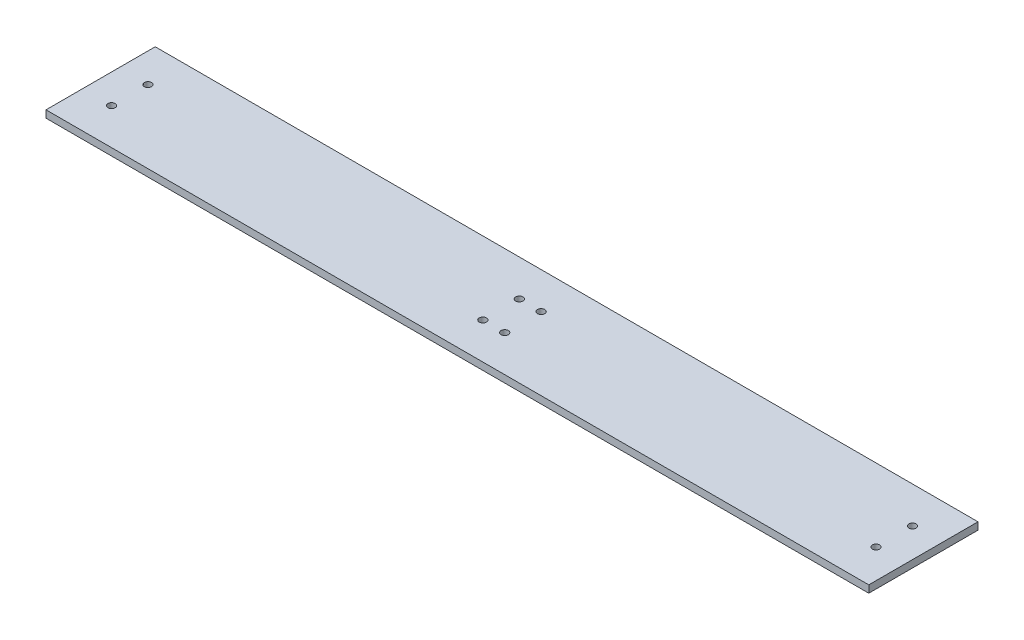
ISO-10303-21;
HEADER;
FILE_DESCRIPTION(('STEP AP214'),'2;1');
FILE_NAME('part.step','',(''),(''),'','','');
FILE_SCHEMA(('AUTOMOTIVE_DESIGN { 1 0 10303 214 1 1 1 1 }'));
ENDSEC;
DATA;
#1=APPLICATION_CONTEXT('core data for automotive mechanical design processes');
#2=APPLICATION_PROTOCOL_DEFINITION('international standard','automotive_design',2000,#1);
#3=PRODUCT_CONTEXT('',#1,'mechanical');
#4=PRODUCT('Part','Part','',(#3));
#5=PRODUCT_RELATED_PRODUCT_CATEGORY('part','',(#4));
#6=PRODUCT_DEFINITION_FORMATION('','',#4);
#7=PRODUCT_DEFINITION_CONTEXT('part definition',#1,'design');
#8=PRODUCT_DEFINITION('design','',#6,#7);
#9=PRODUCT_DEFINITION_SHAPE('','',#8);
#10=(LENGTH_UNIT() NAMED_UNIT(*) SI_UNIT(.MILLI.,.METRE.));
#11=(NAMED_UNIT(*) PLANE_ANGLE_UNIT() SI_UNIT($,.RADIAN.));
#12=(NAMED_UNIT(*) SI_UNIT($,.STERADIAN.) SOLID_ANGLE_UNIT());
#13=UNCERTAINTY_MEASURE_WITH_UNIT(LENGTH_MEASURE(1.E-05),#10,'distance_accuracy_value','');
#14=(GEOMETRIC_REPRESENTATION_CONTEXT(3) GLOBAL_UNCERTAINTY_ASSIGNED_CONTEXT((#13)) GLOBAL_UNIT_ASSIGNED_CONTEXT((#10,
#11,#12)) REPRESENTATION_CONTEXT('',''));
#15=CARTESIAN_POINT('',(0.,0.,0.));
#16=DIRECTION('',(0.,0.,1.));
#17=DIRECTION('',(1.,0.,0.));
#18=AXIS2_PLACEMENT_3D('',#15,#16,#17);
#19=CARTESIAN_POINT('',(1130.,0.,0.));
#20=DIRECTION('',(0.,0.,-1.));
#21=DIRECTION('',(-1.,0.,0.));
#22=AXIS2_PLACEMENT_3D('',#19,#20,#21);
#23=PLANE('',#22);
#24=DIRECTION('',(0.,-1.,0.));
#25=VECTOR('',#24,1.);
#26=CARTESIAN_POINT('',(0.,0.,0.));
#27=LINE('',#26,#25);
#28=CARTESIAN_POINT('',(0.,10.,0.));
#29=VERTEX_POINT('',#28);
#30=CARTESIAN_POINT('',(0.,0.,0.));
#31=VERTEX_POINT('',#30);
#32=EDGE_CURVE('E97',#29,#31,#27,.T.);
#33=ORIENTED_EDGE('',*,*,#32,.T.);
#34=DIRECTION('',(-1.,0.,0.));
#35=VECTOR('',#34,1.);
#36=CARTESIAN_POINT('',(1130.,0.,0.));
#37=LINE('',#36,#35);
#38=CARTESIAN_POINT('',(1130.,0.,0.));
#39=VERTEX_POINT('',#38);
#40=EDGE_CURVE('E11',#39,#31,#37,.T.);
#41=ORIENTED_EDGE('',*,*,#40,.F.);
#42=DIRECTION('',(0.,-1.,0.));
#43=VECTOR('',#42,1.);
#44=CARTESIAN_POINT('',(1130.,0.,0.));
#45=LINE('',#44,#43);
#46=CARTESIAN_POINT('',(1130.,10.,0.));
#47=VERTEX_POINT('',#46);
#48=EDGE_CURVE('E85',#47,#39,#45,.T.);
#49=ORIENTED_EDGE('',*,*,#48,.F.);
#50=DIRECTION('',(-1.,0.,0.));
#51=VECTOR('',#50,1.);
#52=CARTESIAN_POINT('',(1130.,10.,0.));
#53=LINE('',#52,#51);
#54=EDGE_CURVE('E93',#47,#29,#53,.T.);
#55=ORIENTED_EDGE('',*,*,#54,.T.);
#56=EDGE_LOOP('',(#33,#41,#49,#55));
#57=FACE_BOUND('',#56,.T.);
#58=ADVANCED_FACE('F34',(#57),#23,.F.);
#59=CARTESIAN_POINT('',(1130.,0.,0.));
#60=DIRECTION('',(0.,1.,0.));
#61=DIRECTION('',(0.,0.,1.));
#62=AXIS2_PLACEMENT_3D('',#59,#60,#61);
#63=PLANE('',#62);
#64=CARTESIAN_POINT('',(1090.,0.,-50.0000000000001));
#65=DIRECTION('',(0.,1.,0.));
#66=DIRECTION('',(0.,0.,-1.));
#67=AXIS2_PLACEMENT_3D('',#64,#65,#66);
#68=CIRCLE('',#67,4.99999999999982);
#69=CARTESIAN_POINT('',(1090.,0.,-55.));
#70=VERTEX_POINT('',#69);
#71=EDGE_CURVE('E150',#70,#70,#68,.T.);
#72=ORIENTED_EDGE('',*,*,#71,.T.);
#73=EDGE_LOOP('',(#72));
#74=FACE_BOUND('',#73,.T.);
#75=CARTESIAN_POINT('',(580.,0.,-50.));
#76=DIRECTION('',(0.,1.,0.));
#77=DIRECTION('',(0.,0.,-1.));
#78=AXIS2_PLACEMENT_3D('',#75,#76,#77);
#79=CIRCLE('',#78,5.00000000000005);
#80=CARTESIAN_POINT('',(580.,0.,-55.0000000000001));
#81=VERTEX_POINT('',#80);
#82=EDGE_CURVE('E144',#81,#81,#79,.T.);
#83=ORIENTED_EDGE('',*,*,#82,.T.);
#84=EDGE_LOOP('',(#83));
#85=FACE_BOUND('',#84,.T.);
#86=CARTESIAN_POINT('',(580.,0.,-100.));
#87=DIRECTION('',(0.,1.,0.));
#88=DIRECTION('',(0.,0.,-1.));
#89=AXIS2_PLACEMENT_3D('',#86,#87,#88);
#90=CIRCLE('',#89,5.00000000000005);
#91=CARTESIAN_POINT('',(580.,0.,-105.));
#92=VERTEX_POINT('',#91);
#93=EDGE_CURVE('E138',#92,#92,#90,.T.);
#94=ORIENTED_EDGE('',*,*,#93,.T.);
#95=EDGE_LOOP('',(#94));
#96=FACE_BOUND('',#95,.T.);
#97=CARTESIAN_POINT('',(1090.,0.,-100.));
#98=DIRECTION('',(0.,1.,0.));
#99=DIRECTION('',(0.,0.,-1.));
#100=AXIS2_PLACEMENT_3D('',#97,#98,#99);
#101=CIRCLE('',#100,5.00000000000005);
#102=CARTESIAN_POINT('',(1090.,0.,-105.));
#103=VERTEX_POINT('',#102);
#104=EDGE_CURVE('E132',#103,#103,#101,.T.);
#105=ORIENTED_EDGE('',*,*,#104,.T.);
#106=EDGE_LOOP('',(#105));
#107=FACE_BOUND('',#106,.T.);
#108=CARTESIAN_POINT('',(39.9999999999998,0.,-100.));
#109=DIRECTION('',(0.,1.,0.));
#110=DIRECTION('',(0.,0.,1.));
#111=AXIS2_PLACEMENT_3D('',#108,#109,#110);
#112=CIRCLE('',#111,5.);
#113=CARTESIAN_POINT('',(39.9999999999998,0.,-95.));
#114=VERTEX_POINT('',#113);
#115=EDGE_CURVE('E126',#114,#114,#112,.T.);
#116=ORIENTED_EDGE('',*,*,#115,.T.);
#117=EDGE_LOOP('',(#116));
#118=FACE_BOUND('',#117,.T.);
#119=CARTESIAN_POINT('',(550.,0.,-100.));
#120=DIRECTION('',(0.,1.,0.));
#121=DIRECTION('',(0.,0.,1.));
#122=AXIS2_PLACEMENT_3D('',#119,#120,#121);
#123=CIRCLE('',#122,5.00000000000005);
#124=CARTESIAN_POINT('',(550.,0.,-95.));
#125=VERTEX_POINT('',#124);
#126=EDGE_CURVE('E120',#125,#125,#123,.T.);
#127=ORIENTED_EDGE('',*,*,#126,.T.);
#128=EDGE_LOOP('',(#127));
#129=FACE_BOUND('',#128,.T.);
#130=CARTESIAN_POINT('',(550.,0.,-50.));
#131=DIRECTION('',(0.,1.,0.));
#132=DIRECTION('',(0.,0.,1.));
#133=AXIS2_PLACEMENT_3D('',#130,#131,#132);
#134=CIRCLE('',#133,5.00000000000004);
#135=CARTESIAN_POINT('',(550.,0.,-45.));
#136=VERTEX_POINT('',#135);
#137=EDGE_CURVE('E114',#136,#136,#134,.T.);
#138=ORIENTED_EDGE('',*,*,#137,.T.);
#139=EDGE_LOOP('',(#138));
#140=FACE_BOUND('',#139,.T.);
#141=CARTESIAN_POINT('',(40.,0.,-50.));
#142=DIRECTION('',(0.,1.,0.));
#143=DIRECTION('',(0.,0.,1.));
#144=AXIS2_PLACEMENT_3D('',#141,#142,#143);
#145=CIRCLE('',#144,5.);
#146=CARTESIAN_POINT('',(40.,0.,-45.));
#147=VERTEX_POINT('',#146);
#148=EDGE_CURVE('E100',#147,#147,#145,.T.);
#149=ORIENTED_EDGE('',*,*,#148,.T.);
#150=EDGE_LOOP('',(#149));
#151=FACE_BOUND('',#150,.T.);
#152=DIRECTION('',(0.,0.,-1.));
#153=VECTOR('',#152,1.);
#154=CARTESIAN_POINT('',(0.,0.,0.));
#155=LINE('',#154,#153);
#156=CARTESIAN_POINT('',(0.,0.,-150.));
#157=VERTEX_POINT('',#156);
#158=EDGE_CURVE('E89',#31,#157,#155,.T.);
#159=ORIENTED_EDGE('',*,*,#158,.T.);
#160=DIRECTION('',(-1.,0.,0.));
#161=VECTOR('',#160,1.);
#162=CARTESIAN_POINT('',(1130.,0.,-150.));
#163=LINE('',#162,#161);
#164=CARTESIAN_POINT('',(1130.,0.,-150.));
#165=VERTEX_POINT('',#164);
#166=EDGE_CURVE('E42',#165,#157,#163,.T.);
#167=ORIENTED_EDGE('',*,*,#166,.F.);
#168=DIRECTION('',(0.,0.,-1.));
#169=VECTOR('',#168,1.);
#170=CARTESIAN_POINT('',(1130.,0.,0.));
#171=LINE('',#170,#169);
#172=EDGE_CURVE('E80',#39,#165,#171,.T.);
#173=ORIENTED_EDGE('',*,*,#172,.F.);
#174=ORIENTED_EDGE('',*,*,#40,.T.);
#175=EDGE_LOOP('',(#159,#167,#173,#174));
#176=FACE_BOUND('',#175,.T.);
#177=ADVANCED_FACE('F88',(#74,#85,#96,#107,#118,#129,#140,#151,#176),#63,.F.);
#178=CARTESIAN_POINT('',(1130.,0.,-150.));
#179=DIRECTION('',(0.,0.,1.));
#180=DIRECTION('',(1.,0.,0.));
#181=AXIS2_PLACEMENT_3D('',#178,#179,#180);
#182=PLANE('',#181);
#183=DIRECTION('',(0.,1.,0.));
#184=VECTOR('',#183,1.);
#185=CARTESIAN_POINT('',(0.,0.,-150.));
#186=LINE('',#185,#184);
#187=CARTESIAN_POINT('',(0.,10.,-150.));
#188=VERTEX_POINT('',#187);
#189=EDGE_CURVE('E67',#157,#188,#186,.T.);
#190=ORIENTED_EDGE('',*,*,#189,.T.);
#191=DIRECTION('',(-1.,0.,0.));
#192=VECTOR('',#191,1.);
#193=CARTESIAN_POINT('',(1130.,10.,-150.));
#194=LINE('',#193,#192);
#195=CARTESIAN_POINT('',(1130.,10.,-150.));
#196=VERTEX_POINT('',#195);
#197=EDGE_CURVE('E90',#196,#188,#194,.T.);
#198=ORIENTED_EDGE('',*,*,#197,.F.);
#199=DIRECTION('',(0.,1.,0.));
#200=VECTOR('',#199,1.);
#201=CARTESIAN_POINT('',(1130.,0.,-150.));
#202=LINE('',#201,#200);
#203=EDGE_CURVE('E83',#165,#196,#202,.T.);
#204=ORIENTED_EDGE('',*,*,#203,.F.);
#205=ORIENTED_EDGE('',*,*,#166,.T.);
#206=EDGE_LOOP('',(#190,#198,#204,#205));
#207=FACE_BOUND('',#206,.T.);
#208=ADVANCED_FACE('F91',(#207),#182,.F.);
#209=CARTESIAN_POINT('',(1130.,10.,0.));
#210=DIRECTION('',(0.,-1.,0.));
#211=DIRECTION('',(0.,0.,-1.));
#212=AXIS2_PLACEMENT_3D('',#209,#210,#211);
#213=PLANE('',#212);
#214=CARTESIAN_POINT('',(1090.,10.,-50.0000000000001));
#215=DIRECTION('',(0.,1.,0.));
#216=DIRECTION('',(0.,0.,-1.));
#217=AXIS2_PLACEMENT_3D('',#214,#215,#216);
#218=CIRCLE('',#217,4.99999999999982);
#219=CARTESIAN_POINT('',(1090.,10.,-55.));
#220=VERTEX_POINT('',#219);
#221=EDGE_CURVE('E153',#220,#220,#218,.T.);
#222=ORIENTED_EDGE('',*,*,#221,.F.);
#223=EDGE_LOOP('',(#222));
#224=FACE_BOUND('',#223,.T.);
#225=CARTESIAN_POINT('',(580.,10.,-50.));
#226=DIRECTION('',(0.,1.,0.));
#227=DIRECTION('',(0.,0.,-1.));
#228=AXIS2_PLACEMENT_3D('',#225,#226,#227);
#229=CIRCLE('',#228,5.00000000000005);
#230=CARTESIAN_POINT('',(580.,10.,-55.0000000000001));
#231=VERTEX_POINT('',#230);
#232=EDGE_CURVE('E147',#231,#231,#229,.T.);
#233=ORIENTED_EDGE('',*,*,#232,.F.);
#234=EDGE_LOOP('',(#233));
#235=FACE_BOUND('',#234,.T.);
#236=CARTESIAN_POINT('',(580.,10.,-100.));
#237=DIRECTION('',(0.,1.,0.));
#238=DIRECTION('',(0.,0.,-1.));
#239=AXIS2_PLACEMENT_3D('',#236,#237,#238);
#240=CIRCLE('',#239,5.00000000000005);
#241=CARTESIAN_POINT('',(580.,10.,-105.));
#242=VERTEX_POINT('',#241);
#243=EDGE_CURVE('E141',#242,#242,#240,.T.);
#244=ORIENTED_EDGE('',*,*,#243,.F.);
#245=EDGE_LOOP('',(#244));
#246=FACE_BOUND('',#245,.T.);
#247=CARTESIAN_POINT('',(1090.,10.,-100.));
#248=DIRECTION('',(0.,1.,0.));
#249=DIRECTION('',(0.,0.,-1.));
#250=AXIS2_PLACEMENT_3D('',#247,#248,#249);
#251=CIRCLE('',#250,5.00000000000005);
#252=CARTESIAN_POINT('',(1090.,10.,-105.));
#253=VERTEX_POINT('',#252);
#254=EDGE_CURVE('E135',#253,#253,#251,.T.);
#255=ORIENTED_EDGE('',*,*,#254,.F.);
#256=EDGE_LOOP('',(#255));
#257=FACE_BOUND('',#256,.T.);
#258=CARTESIAN_POINT('',(39.9999999999998,10.,-100.));
#259=DIRECTION('',(0.,1.,0.));
#260=DIRECTION('',(0.,0.,1.));
#261=AXIS2_PLACEMENT_3D('',#258,#259,#260);
#262=CIRCLE('',#261,5.);
#263=CARTESIAN_POINT('',(39.9999999999998,10.,-95.));
#264=VERTEX_POINT('',#263);
#265=EDGE_CURVE('E129',#264,#264,#262,.T.);
#266=ORIENTED_EDGE('',*,*,#265,.F.);
#267=EDGE_LOOP('',(#266));
#268=FACE_BOUND('',#267,.T.);
#269=CARTESIAN_POINT('',(550.,10.,-100.));
#270=DIRECTION('',(0.,1.,0.));
#271=DIRECTION('',(0.,0.,1.));
#272=AXIS2_PLACEMENT_3D('',#269,#270,#271);
#273=CIRCLE('',#272,5.00000000000005);
#274=CARTESIAN_POINT('',(550.,10.,-95.));
#275=VERTEX_POINT('',#274);
#276=EDGE_CURVE('E123',#275,#275,#273,.T.);
#277=ORIENTED_EDGE('',*,*,#276,.F.);
#278=EDGE_LOOP('',(#277));
#279=FACE_BOUND('',#278,.T.);
#280=CARTESIAN_POINT('',(550.,10.,-50.));
#281=DIRECTION('',(0.,1.,0.));
#282=DIRECTION('',(0.,0.,1.));
#283=AXIS2_PLACEMENT_3D('',#280,#281,#282);
#284=CIRCLE('',#283,5.00000000000004);
#285=CARTESIAN_POINT('',(550.,10.,-45.));
#286=VERTEX_POINT('',#285);
#287=EDGE_CURVE('E117',#286,#286,#284,.T.);
#288=ORIENTED_EDGE('',*,*,#287,.F.);
#289=EDGE_LOOP('',(#288));
#290=FACE_BOUND('',#289,.T.);
#291=CARTESIAN_POINT('',(40.,10.,-50.));
#292=DIRECTION('',(0.,1.,0.));
#293=DIRECTION('',(0.,0.,1.));
#294=AXIS2_PLACEMENT_3D('',#291,#292,#293);
#295=CIRCLE('',#294,5.);
#296=CARTESIAN_POINT('',(40.,10.,-45.));
#297=VERTEX_POINT('',#296);
#298=EDGE_CURVE('E111',#297,#297,#295,.T.);
#299=ORIENTED_EDGE('',*,*,#298,.F.);
#300=EDGE_LOOP('',(#299));
#301=FACE_BOUND('',#300,.T.);
#302=DIRECTION('',(0.,0.,1.));
#303=VECTOR('',#302,1.);
#304=CARTESIAN_POINT('',(0.,10.,0.));
#305=LINE('',#304,#303);
#306=EDGE_CURVE('E73',#188,#29,#305,.T.);
#307=ORIENTED_EDGE('',*,*,#306,.T.);
#308=ORIENTED_EDGE('',*,*,#54,.F.);
#309=DIRECTION('',(0.,0.,1.));
#310=VECTOR('',#309,1.);
#311=CARTESIAN_POINT('',(1130.,10.,0.));
#312=LINE('',#311,#310);
#313=EDGE_CURVE('E50',#196,#47,#312,.T.);
#314=ORIENTED_EDGE('',*,*,#313,.F.);
#315=ORIENTED_EDGE('',*,*,#197,.T.);
#316=EDGE_LOOP('',(#307,#308,#314,#315));
#317=FACE_BOUND('',#316,.T.);
#318=ADVANCED_FACE('F105',(#224,#235,#246,#257,#268,#279,#290,#301,#317),#213,.F.);
#319=CARTESIAN_POINT('',(1130.,0.,0.));
#320=DIRECTION('',(-1.,0.,0.));
#321=DIRECTION('',(0.,0.,1.));
#322=AXIS2_PLACEMENT_3D('',#319,#320,#321);
#323=PLANE('',#322);
#324=ORIENTED_EDGE('',*,*,#48,.T.);
#325=ORIENTED_EDGE('',*,*,#172,.T.);
#326=ORIENTED_EDGE('',*,*,#203,.T.);
#327=ORIENTED_EDGE('',*,*,#313,.T.);
#328=EDGE_LOOP('',(#324,#325,#326,#327));
#329=FACE_BOUND('',#328,.T.);
#330=ADVANCED_FACE('F81',(#329),#323,.F.);
#331=CARTESIAN_POINT('',(0.,0.,0.));
#332=DIRECTION('',(-1.,0.,0.));
#333=DIRECTION('',(0.,0.,1.));
#334=AXIS2_PLACEMENT_3D('',#331,#332,#333);
#335=PLANE('',#334);
#336=ORIENTED_EDGE('',*,*,#32,.F.);
#337=ORIENTED_EDGE('',*,*,#306,.F.);
#338=ORIENTED_EDGE('',*,*,#189,.F.);
#339=ORIENTED_EDGE('',*,*,#158,.F.);
#340=EDGE_LOOP('',(#336,#337,#338,#339));
#341=FACE_BOUND('',#340,.T.);
#342=ADVANCED_FACE('F108',(#341),#335,.T.);
#343=CARTESIAN_POINT('',(40.,0.,-50.));
#344=DIRECTION('',(0.,1.,0.));
#345=DIRECTION('',(0.,0.,1.));
#346=AXIS2_PLACEMENT_3D('',#343,#344,#345);
#347=CYLINDRICAL_SURFACE('',#346,5.);
#348=ORIENTED_EDGE('',*,*,#148,.F.);
#349=EDGE_LOOP('',(#348));
#350=FACE_BOUND('',#349,.T.);
#351=ORIENTED_EDGE('',*,*,#298,.T.);
#352=EDGE_LOOP('',(#351));
#353=FACE_BOUND('',#352,.T.);
#354=ADVANCED_FACE('F185',(#350,#353),#347,.F.);
#355=CARTESIAN_POINT('',(550.,0.,-50.));
#356=DIRECTION('',(0.,1.,0.));
#357=DIRECTION('',(0.,0.,1.));
#358=AXIS2_PLACEMENT_3D('',#355,#356,#357);
#359=CYLINDRICAL_SURFACE('',#358,5.00000000000004);
#360=ORIENTED_EDGE('',*,*,#137,.F.);
#361=EDGE_LOOP('',(#360));
#362=FACE_BOUND('',#361,.T.);
#363=ORIENTED_EDGE('',*,*,#287,.T.);
#364=EDGE_LOOP('',(#363));
#365=FACE_BOUND('',#364,.T.);
#366=ADVANCED_FACE('F187',(#362,#365),#359,.F.);
#367=CARTESIAN_POINT('',(550.,0.,-100.));
#368=DIRECTION('',(0.,1.,0.));
#369=DIRECTION('',(0.,0.,1.));
#370=AXIS2_PLACEMENT_3D('',#367,#368,#369);
#371=CYLINDRICAL_SURFACE('',#370,5.00000000000005);
#372=ORIENTED_EDGE('',*,*,#126,.F.);
#373=EDGE_LOOP('',(#372));
#374=FACE_BOUND('',#373,.T.);
#375=ORIENTED_EDGE('',*,*,#276,.T.);
#376=EDGE_LOOP('',(#375));
#377=FACE_BOUND('',#376,.T.);
#378=ADVANCED_FACE('F194',(#374,#377),#371,.F.);
#379=CARTESIAN_POINT('',(39.9999999999998,0.,-100.));
#380=DIRECTION('',(0.,1.,0.));
#381=DIRECTION('',(0.,0.,1.));
#382=AXIS2_PLACEMENT_3D('',#379,#380,#381);
#383=CYLINDRICAL_SURFACE('',#382,5.);
#384=ORIENTED_EDGE('',*,*,#115,.F.);
#385=EDGE_LOOP('',(#384));
#386=FACE_BOUND('',#385,.T.);
#387=ORIENTED_EDGE('',*,*,#265,.T.);
#388=EDGE_LOOP('',(#387));
#389=FACE_BOUND('',#388,.T.);
#390=ADVANCED_FACE('F247',(#386,#389),#383,.F.);
#391=CARTESIAN_POINT('',(1090.,0.,-100.));
#392=DIRECTION('',(0.,1.,0.));
#393=DIRECTION('',(0.,0.,1.));
#394=AXIS2_PLACEMENT_3D('',#391,#392,#393);
#395=CYLINDRICAL_SURFACE('',#394,5.00000000000005);
#396=ORIENTED_EDGE('',*,*,#104,.F.);
#397=EDGE_LOOP('',(#396));
#398=FACE_BOUND('',#397,.T.);
#399=ORIENTED_EDGE('',*,*,#254,.T.);
#400=EDGE_LOOP('',(#399));
#401=FACE_BOUND('',#400,.T.);
#402=ADVANCED_FACE('F257',(#398,#401),#395,.F.);
#403=CARTESIAN_POINT('',(580.,0.,-100.));
#404=DIRECTION('',(0.,1.,0.));
#405=DIRECTION('',(0.,0.,1.));
#406=AXIS2_PLACEMENT_3D('',#403,#404,#405);
#407=CYLINDRICAL_SURFACE('',#406,5.00000000000005);
#408=ORIENTED_EDGE('',*,*,#93,.F.);
#409=EDGE_LOOP('',(#408));
#410=FACE_BOUND('',#409,.T.);
#411=ORIENTED_EDGE('',*,*,#243,.T.);
#412=EDGE_LOOP('',(#411));
#413=FACE_BOUND('',#412,.T.);
#414=ADVANCED_FACE('F267',(#410,#413),#407,.F.);
#415=CARTESIAN_POINT('',(580.,0.,-50.));
#416=DIRECTION('',(0.,1.,0.));
#417=DIRECTION('',(0.,0.,1.));
#418=AXIS2_PLACEMENT_3D('',#415,#416,#417);
#419=CYLINDRICAL_SURFACE('',#418,5.00000000000005);
#420=ORIENTED_EDGE('',*,*,#82,.F.);
#421=EDGE_LOOP('',(#420));
#422=FACE_BOUND('',#421,.T.);
#423=ORIENTED_EDGE('',*,*,#232,.T.);
#424=EDGE_LOOP('',(#423));
#425=FACE_BOUND('',#424,.T.);
#426=ADVANCED_FACE('F164',(#422,#425),#419,.F.);
#427=CARTESIAN_POINT('',(1090.,0.,-50.0000000000001));
#428=DIRECTION('',(0.,1.,0.));
#429=DIRECTION('',(0.,0.,1.));
#430=AXIS2_PLACEMENT_3D('',#427,#428,#429);
#431=CYLINDRICAL_SURFACE('',#430,4.99999999999982);
#432=ORIENTED_EDGE('',*,*,#71,.F.);
#433=EDGE_LOOP('',(#432));
#434=FACE_BOUND('',#433,.T.);
#435=ORIENTED_EDGE('',*,*,#221,.T.);
#436=EDGE_LOOP('',(#435));
#437=FACE_BOUND('',#436,.T.);
#438=ADVANCED_FACE('F161',(#434,#437),#431,.F.);
#439=CLOSED_SHELL('',(#58,#177,#208,#318,#330,#342,#354,#366,#378,#390,#402,#414,#426,#438));
#440=MANIFOLD_SOLID_BREP('B2',#439);
#441=ADVANCED_BREP_SHAPE_REPRESENTATION('',(#18,#440),#14);
#442=SHAPE_DEFINITION_REPRESENTATION(#9,#441);
ENDSEC;
END-ISO-10303-21;
